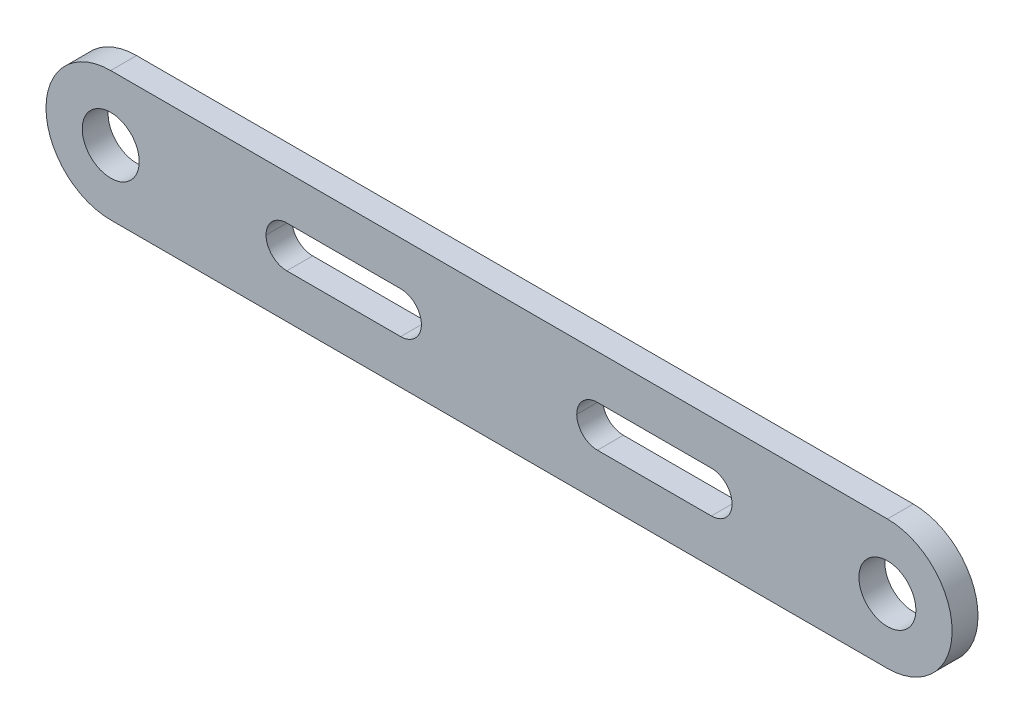
ISO-10303-21;
HEADER;
FILE_DESCRIPTION(('STEP AP214'),'2;1');
FILE_NAME('part.step','',(''),(''),'','','');
FILE_SCHEMA(('AUTOMOTIVE_DESIGN { 1 0 10303 214 1 1 1 1 }'));
ENDSEC;
DATA;
#1=APPLICATION_CONTEXT('core data for automotive mechanical design processes');
#2=APPLICATION_PROTOCOL_DEFINITION('international standard','automotive_design',2000,#1);
#3=PRODUCT_CONTEXT('',#1,'mechanical');
#4=PRODUCT('Part','Part','',(#3));
#5=PRODUCT_RELATED_PRODUCT_CATEGORY('part','',(#4));
#6=PRODUCT_DEFINITION_FORMATION('','',#4);
#7=PRODUCT_DEFINITION_CONTEXT('part definition',#1,'design');
#8=PRODUCT_DEFINITION('design','',#6,#7);
#9=PRODUCT_DEFINITION_SHAPE('','',#8);
#10=(LENGTH_UNIT() NAMED_UNIT(*) SI_UNIT(.MILLI.,.METRE.));
#11=(NAMED_UNIT(*) PLANE_ANGLE_UNIT() SI_UNIT($,.RADIAN.));
#12=(NAMED_UNIT(*) SI_UNIT($,.STERADIAN.) SOLID_ANGLE_UNIT());
#13=UNCERTAINTY_MEASURE_WITH_UNIT(LENGTH_MEASURE(1.E-05),#10,'distance_accuracy_value','');
#14=(GEOMETRIC_REPRESENTATION_CONTEXT(3) GLOBAL_UNCERTAINTY_ASSIGNED_CONTEXT((#13)) GLOBAL_UNIT_ASSIGNED_CONTEXT((#10,
#11,#12)) REPRESENTATION_CONTEXT('',''));
#15=CARTESIAN_POINT('',(0.,0.,0.));
#16=DIRECTION('',(0.,0.,1.));
#17=DIRECTION('',(1.,0.,0.));
#18=AXIS2_PLACEMENT_3D('',#15,#16,#17);
#19=CARTESIAN_POINT('',(-75.,0.,5.));
#20=DIRECTION('',(0.,0.,1.));
#21=DIRECTION('',(1.,0.,0.));
#22=AXIS2_PLACEMENT_3D('',#19,#20,#21);
#23=PLANE('',#22);
#24=DIRECTION('',(-1.,0.,0.));
#25=VECTOR('',#24,1.);
#26=CARTESIAN_POINT('',(-75.,4.00000000000001,5.));
#27=LINE('',#26,#25);
#28=CARTESIAN_POINT('',(41.,4.00000000000001,5.));
#29=VERTEX_POINT('',#28);
#30=CARTESIAN_POINT('',(19.,4.00000000000001,5.));
#31=VERTEX_POINT('',#30);
#32=EDGE_CURVE('E275',#29,#31,#27,.T.);
#33=ORIENTED_EDGE('',*,*,#32,.F.);
#34=CARTESIAN_POINT('',(41.,0.,5.));
#35=DIRECTION('',(0.,0.,1.));
#36=DIRECTION('',(1.,0.,0.));
#37=AXIS2_PLACEMENT_3D('',#34,#35,#36);
#38=CIRCLE('',#37,4.);
#39=CARTESIAN_POINT('',(45.,0.,5.));
#40=VERTEX_POINT('',#39);
#41=EDGE_CURVE('E213',#29,#40,#38,.F.);
#42=ORIENTED_EDGE('',*,*,#41,.T.);
#43=CARTESIAN_POINT('',(41.,0.,5.));
#44=DIRECTION('',(0.,0.,1.));
#45=DIRECTION('',(1.,0.,0.));
#46=AXIS2_PLACEMENT_3D('',#43,#44,#45);
#47=CIRCLE('',#46,4.);
#48=CARTESIAN_POINT('',(41.,-4.00000000000002,5.));
#49=VERTEX_POINT('',#48);
#50=EDGE_CURVE('E209',#40,#49,#47,.F.);
#51=ORIENTED_EDGE('',*,*,#50,.T.);
#52=DIRECTION('',(1.,0.,0.));
#53=VECTOR('',#52,1.);
#54=CARTESIAN_POINT('',(-75.,-4.00000000000002,5.));
#55=LINE('',#54,#53);
#56=CARTESIAN_POINT('',(19.,-4.00000000000002,5.));
#57=VERTEX_POINT('',#56);
#58=EDGE_CURVE('E272',#57,#49,#55,.T.);
#59=ORIENTED_EDGE('',*,*,#58,.F.);
#60=CARTESIAN_POINT('',(19.,0.,5.));
#61=DIRECTION('',(0.,0.,1.));
#62=DIRECTION('',(1.,0.,0.));
#63=AXIS2_PLACEMENT_3D('',#60,#61,#62);
#64=CIRCLE('',#63,4.);
#65=CARTESIAN_POINT('',(15.,0.,5.));
#66=VERTEX_POINT('',#65);
#67=EDGE_CURVE('E205',#57,#66,#64,.F.);
#68=ORIENTED_EDGE('',*,*,#67,.T.);
#69=CARTESIAN_POINT('',(19.,0.,5.));
#70=DIRECTION('',(0.,0.,1.));
#71=DIRECTION('',(1.,0.,0.));
#72=AXIS2_PLACEMENT_3D('',#69,#70,#71);
#73=CIRCLE('',#72,4.);
#74=EDGE_CURVE('E217',#66,#31,#73,.F.);
#75=ORIENTED_EDGE('',*,*,#74,.T.);
#76=EDGE_LOOP('',(#33,#42,#51,#59,#68,#75));
#77=FACE_BOUND('',#76,.T.);
#78=DIRECTION('',(-1.,0.,0.));
#79=VECTOR('',#78,1.);
#80=CARTESIAN_POINT('',(-75.,4.00000000000001,5.));
#81=LINE('',#80,#79);
#82=CARTESIAN_POINT('',(-19.,4.00000000000001,5.));
#83=VERTEX_POINT('',#82);
#84=CARTESIAN_POINT('',(-41.,4.00000000000001,5.));
#85=VERTEX_POINT('',#84);
#86=EDGE_CURVE('E270',#83,#85,#81,.T.);
#87=ORIENTED_EDGE('',*,*,#86,.F.);
#88=CARTESIAN_POINT('',(-19.,0.,5.));
#89=DIRECTION('',(0.,0.,1.));
#90=DIRECTION('',(1.,0.,0.));
#91=AXIS2_PLACEMENT_3D('',#88,#89,#90);
#92=CIRCLE('',#91,4.);
#93=CARTESIAN_POINT('',(-15.,0.,5.));
#94=VERTEX_POINT('',#93);
#95=EDGE_CURVE('E55',#83,#94,#92,.F.);
#96=ORIENTED_EDGE('',*,*,#95,.T.);
#97=CARTESIAN_POINT('',(-19.,0.,5.));
#98=DIRECTION('',(0.,0.,1.));
#99=DIRECTION('',(1.,0.,0.));
#100=AXIS2_PLACEMENT_3D('',#97,#98,#99);
#101=CIRCLE('',#100,4.);
#102=CARTESIAN_POINT('',(-19.,-4.00000000000001,5.));
#103=VERTEX_POINT('',#102);
#104=EDGE_CURVE('E224',#94,#103,#101,.F.);
#105=ORIENTED_EDGE('',*,*,#104,.T.);
#106=DIRECTION('',(1.,0.,0.));
#107=VECTOR('',#106,1.);
#108=CARTESIAN_POINT('',(-75.,-4.00000000000001,5.));
#109=LINE('',#108,#107);
#110=CARTESIAN_POINT('',(-41.,-4.00000000000001,5.));
#111=VERTEX_POINT('',#110);
#112=EDGE_CURVE('E267',#111,#103,#109,.T.);
#113=ORIENTED_EDGE('',*,*,#112,.F.);
#114=CARTESIAN_POINT('',(-41.,0.,5.));
#115=DIRECTION('',(0.,0.,1.));
#116=DIRECTION('',(1.,0.,0.));
#117=AXIS2_PLACEMENT_3D('',#114,#115,#116);
#118=CIRCLE('',#117,4.);
#119=CARTESIAN_POINT('',(-45.,0.,5.));
#120=VERTEX_POINT('',#119);
#121=EDGE_CURVE('E221',#111,#120,#118,.F.);
#122=ORIENTED_EDGE('',*,*,#121,.T.);
#123=CARTESIAN_POINT('',(-41.,0.,5.));
#124=DIRECTION('',(0.,0.,1.));
#125=DIRECTION('',(1.,0.,0.));
#126=AXIS2_PLACEMENT_3D('',#123,#124,#125);
#127=CIRCLE('',#126,4.);
#128=EDGE_CURVE('E11',#120,#85,#127,.F.);
#129=ORIENTED_EDGE('',*,*,#128,.T.);
#130=EDGE_LOOP('',(#87,#96,#105,#113,#122,#129));
#131=FACE_BOUND('',#130,.T.);
#132=CARTESIAN_POINT('',(75.,0.,5.));
#133=DIRECTION('',(0.,0.,1.));
#134=DIRECTION('',(-1.,0.,0.));
#135=AXIS2_PLACEMENT_3D('',#132,#133,#134);
#136=CIRCLE('',#135,5.5);
#137=CARTESIAN_POINT('',(69.5,0.,5.));
#138=VERTEX_POINT('',#137);
#139=EDGE_CURVE('E285',#138,#138,#136,.T.);
#140=ORIENTED_EDGE('',*,*,#139,.F.);
#141=EDGE_LOOP('',(#140));
#142=FACE_BOUND('',#141,.T.);
#143=CARTESIAN_POINT('',(-75.,0.,5.));
#144=DIRECTION('',(0.,0.,1.));
#145=DIRECTION('',(1.,0.,0.));
#146=AXIS2_PLACEMENT_3D('',#143,#144,#145);
#147=CIRCLE('',#146,12.5);
#148=CARTESIAN_POINT('',(-75.,12.5,5.));
#149=VERTEX_POINT('',#148);
#150=CARTESIAN_POINT('',(-75.,-12.5,5.));
#151=VERTEX_POINT('',#150);
#152=EDGE_CURVE('E164',#149,#151,#147,.T.);
#153=ORIENTED_EDGE('',*,*,#152,.T.);
#154=DIRECTION('',(1.,0.,0.));
#155=VECTOR('',#154,1.);
#156=CARTESIAN_POINT('',(75.,-12.5,5.));
#157=LINE('',#156,#155);
#158=CARTESIAN_POINT('',(75.,-12.5,5.));
#159=VERTEX_POINT('',#158);
#160=EDGE_CURVE('E153',#151,#159,#157,.T.);
#161=ORIENTED_EDGE('',*,*,#160,.T.);
#162=CARTESIAN_POINT('',(75.,0.,5.));
#163=DIRECTION('',(0.,0.,1.));
#164=DIRECTION('',(-1.,0.,0.));
#165=AXIS2_PLACEMENT_3D('',#162,#163,#164);
#166=CIRCLE('',#165,12.5);
#167=CARTESIAN_POINT('',(75.,12.5,5.));
#168=VERTEX_POINT('',#167);
#169=EDGE_CURVE('E163',#159,#168,#166,.T.);
#170=ORIENTED_EDGE('',*,*,#169,.T.);
#171=DIRECTION('',(-1.,0.,0.));
#172=VECTOR('',#171,1.);
#173=CARTESIAN_POINT('',(75.,12.5,5.));
#174=LINE('',#173,#172);
#175=EDGE_CURVE('E169',#168,#149,#174,.T.);
#176=ORIENTED_EDGE('',*,*,#175,.T.);
#177=EDGE_LOOP('',(#153,#161,#170,#176));
#178=FACE_BOUND('',#177,.T.);
#179=CARTESIAN_POINT('',(-75.,0.,5.));
#180=DIRECTION('',(0.,0.,1.));
#181=DIRECTION('',(1.,0.,0.));
#182=AXIS2_PLACEMENT_3D('',#179,#180,#181);
#183=CIRCLE('',#182,5.5);
#184=CARTESIAN_POINT('',(-69.5,0.,5.));
#185=VERTEX_POINT('',#184);
#186=EDGE_CURVE('E279',#185,#185,#183,.T.);
#187=ORIENTED_EDGE('',*,*,#186,.F.);
#188=EDGE_LOOP('',(#187));
#189=FACE_BOUND('',#188,.T.);
#190=ADVANCED_FACE('F38',(#77,#131,#142,#178,#189),#23,.T.);
#191=CARTESIAN_POINT('',(-75.,0.,0.));
#192=DIRECTION('',(0.,0.,1.));
#193=DIRECTION('',(1.,0.,0.));
#194=AXIS2_PLACEMENT_3D('',#191,#192,#193);
#195=PLANE('',#194);
#196=CARTESIAN_POINT('',(41.,0.,0.));
#197=DIRECTION('',(0.,0.,1.));
#198=DIRECTION('',(1.,0.,0.));
#199=AXIS2_PLACEMENT_3D('',#196,#197,#198);
#200=CIRCLE('',#199,4.);
#201=CARTESIAN_POINT('',(41.,-4.00000000000002,0.));
#202=VERTEX_POINT('',#201);
#203=CARTESIAN_POINT('',(45.,0.,0.));
#204=VERTEX_POINT('',#203);
#205=EDGE_CURVE('E207',#202,#204,#200,.T.);
#206=ORIENTED_EDGE('',*,*,#205,.T.);
#207=CARTESIAN_POINT('',(41.,0.,0.));
#208=DIRECTION('',(0.,0.,1.));
#209=DIRECTION('',(1.,0.,0.));
#210=AXIS2_PLACEMENT_3D('',#207,#208,#209);
#211=CIRCLE('',#210,4.);
#212=CARTESIAN_POINT('',(41.,4.00000000000001,0.));
#213=VERTEX_POINT('',#212);
#214=EDGE_CURVE('E211',#204,#213,#211,.T.);
#215=ORIENTED_EDGE('',*,*,#214,.T.);
#216=DIRECTION('',(1.,0.,0.));
#217=VECTOR('',#216,1.);
#218=CARTESIAN_POINT('',(45.,4.00000000000001,0.));
#219=LINE('',#218,#217);
#220=CARTESIAN_POINT('',(19.,4.00000000000001,0.));
#221=VERTEX_POINT('',#220);
#222=EDGE_CURVE('E261',#221,#213,#219,.T.);
#223=ORIENTED_EDGE('',*,*,#222,.F.);
#224=CARTESIAN_POINT('',(19.,0.,0.));
#225=DIRECTION('',(0.,0.,1.));
#226=DIRECTION('',(1.,0.,0.));
#227=AXIS2_PLACEMENT_3D('',#224,#225,#226);
#228=CIRCLE('',#227,4.);
#229=CARTESIAN_POINT('',(15.,0.,0.));
#230=VERTEX_POINT('',#229);
#231=EDGE_CURVE('E215',#221,#230,#228,.T.);
#232=ORIENTED_EDGE('',*,*,#231,.T.);
#233=CARTESIAN_POINT('',(19.,0.,0.));
#234=DIRECTION('',(0.,0.,1.));
#235=DIRECTION('',(1.,0.,0.));
#236=AXIS2_PLACEMENT_3D('',#233,#234,#235);
#237=CIRCLE('',#236,4.);
#238=CARTESIAN_POINT('',(19.,-4.00000000000002,0.));
#239=VERTEX_POINT('',#238);
#240=EDGE_CURVE('E203',#230,#239,#237,.T.);
#241=ORIENTED_EDGE('',*,*,#240,.T.);
#242=DIRECTION('',(-1.,0.,0.));
#243=VECTOR('',#242,1.);
#244=CARTESIAN_POINT('',(45.,-4.00000000000002,0.));
#245=LINE('',#244,#243);
#246=EDGE_CURVE('E258',#202,#239,#245,.T.);
#247=ORIENTED_EDGE('',*,*,#246,.F.);
#248=EDGE_LOOP('',(#206,#215,#223,#232,#241,#247));
#249=FACE_BOUND('',#248,.T.);
#250=CARTESIAN_POINT('',(-19.,0.,0.));
#251=DIRECTION('',(0.,0.,1.));
#252=DIRECTION('',(1.,0.,0.));
#253=AXIS2_PLACEMENT_3D('',#250,#251,#252);
#254=CIRCLE('',#253,4.);
#255=CARTESIAN_POINT('',(-19.,-4.00000000000001,0.));
#256=VERTEX_POINT('',#255);
#257=CARTESIAN_POINT('',(-15.,0.,0.));
#258=VERTEX_POINT('',#257);
#259=EDGE_CURVE('E63',#256,#258,#254,.T.);
#260=ORIENTED_EDGE('',*,*,#259,.T.);
#261=CARTESIAN_POINT('',(-19.,0.,0.));
#262=DIRECTION('',(0.,0.,1.));
#263=DIRECTION('',(1.,0.,0.));
#264=AXIS2_PLACEMENT_3D('',#261,#262,#263);
#265=CIRCLE('',#264,4.);
#266=CARTESIAN_POINT('',(-19.,4.00000000000001,0.));
#267=VERTEX_POINT('',#266);
#268=EDGE_CURVE('E226',#258,#267,#265,.T.);
#269=ORIENTED_EDGE('',*,*,#268,.T.);
#270=DIRECTION('',(1.,0.,0.));
#271=VECTOR('',#270,1.);
#272=CARTESIAN_POINT('',(-15.,4.00000000000001,0.));
#273=LINE('',#272,#271);
#274=CARTESIAN_POINT('',(-41.,4.00000000000001,0.));
#275=VERTEX_POINT('',#274);
#276=EDGE_CURVE('E252',#275,#267,#273,.T.);
#277=ORIENTED_EDGE('',*,*,#276,.F.);
#278=CARTESIAN_POINT('',(-41.,0.,0.));
#279=DIRECTION('',(0.,0.,1.));
#280=DIRECTION('',(1.,0.,0.));
#281=AXIS2_PLACEMENT_3D('',#278,#279,#280);
#282=CIRCLE('',#281,4.);
#283=CARTESIAN_POINT('',(-45.,0.,0.));
#284=VERTEX_POINT('',#283);
#285=EDGE_CURVE('E47',#275,#284,#282,.T.);
#286=ORIENTED_EDGE('',*,*,#285,.T.);
#287=CARTESIAN_POINT('',(-41.,0.,0.));
#288=DIRECTION('',(0.,0.,1.));
#289=DIRECTION('',(1.,0.,0.));
#290=AXIS2_PLACEMENT_3D('',#287,#288,#289);
#291=CIRCLE('',#290,4.);
#292=CARTESIAN_POINT('',(-41.,-4.00000000000001,0.));
#293=VERTEX_POINT('',#292);
#294=EDGE_CURVE('E219',#284,#293,#291,.T.);
#295=ORIENTED_EDGE('',*,*,#294,.T.);
#296=DIRECTION('',(-1.,0.,0.));
#297=VECTOR('',#296,1.);
#298=CARTESIAN_POINT('',(-15.,-4.00000000000001,0.));
#299=LINE('',#298,#297);
#300=EDGE_CURVE('E233',#256,#293,#299,.T.);
#301=ORIENTED_EDGE('',*,*,#300,.F.);
#302=EDGE_LOOP('',(#260,#269,#277,#286,#295,#301));
#303=FACE_BOUND('',#302,.T.);
#304=CARTESIAN_POINT('',(-75.,0.,0.));
#305=DIRECTION('',(0.,0.,1.));
#306=DIRECTION('',(1.,0.,0.));
#307=AXIS2_PLACEMENT_3D('',#304,#305,#306);
#308=CIRCLE('',#307,12.5);
#309=CARTESIAN_POINT('',(-75.,12.5,0.));
#310=VERTEX_POINT('',#309);
#311=CARTESIAN_POINT('',(-75.,-12.5,0.));
#312=VERTEX_POINT('',#311);
#313=EDGE_CURVE('E177',#310,#312,#308,.T.);
#314=ORIENTED_EDGE('',*,*,#313,.F.);
#315=DIRECTION('',(-1.,0.,0.));
#316=VECTOR('',#315,1.);
#317=CARTESIAN_POINT('',(75.,12.5,0.));
#318=LINE('',#317,#316);
#319=CARTESIAN_POINT('',(75.,12.5,0.));
#320=VERTEX_POINT('',#319);
#321=EDGE_CURVE('E173',#320,#310,#318,.T.);
#322=ORIENTED_EDGE('',*,*,#321,.F.);
#323=CARTESIAN_POINT('',(75.,0.,0.));
#324=DIRECTION('',(0.,0.,1.));
#325=DIRECTION('',(-1.,0.,0.));
#326=AXIS2_PLACEMENT_3D('',#323,#324,#325);
#327=CIRCLE('',#326,12.5);
#328=CARTESIAN_POINT('',(75.,-12.5,0.));
#329=VERTEX_POINT('',#328);
#330=EDGE_CURVE('E296',#329,#320,#327,.T.);
#331=ORIENTED_EDGE('',*,*,#330,.F.);
#332=DIRECTION('',(1.,0.,0.));
#333=VECTOR('',#332,1.);
#334=CARTESIAN_POINT('',(75.,-12.5,0.));
#335=LINE('',#334,#333);
#336=EDGE_CURVE('E294',#312,#329,#335,.T.);
#337=ORIENTED_EDGE('',*,*,#336,.F.);
#338=EDGE_LOOP('',(#314,#322,#331,#337));
#339=FACE_BOUND('',#338,.T.);
#340=CARTESIAN_POINT('',(75.,0.,0.));
#341=DIRECTION('',(0.,0.,1.));
#342=DIRECTION('',(-1.,0.,0.));
#343=AXIS2_PLACEMENT_3D('',#340,#341,#342);
#344=CIRCLE('',#343,5.5);
#345=CARTESIAN_POINT('',(69.5,0.,0.));
#346=VERTEX_POINT('',#345);
#347=EDGE_CURVE('E282',#346,#346,#344,.T.);
#348=ORIENTED_EDGE('',*,*,#347,.T.);
#349=EDGE_LOOP('',(#348));
#350=FACE_BOUND('',#349,.T.);
#351=CARTESIAN_POINT('',(-75.,0.,0.));
#352=DIRECTION('',(0.,0.,1.));
#353=DIRECTION('',(1.,0.,0.));
#354=AXIS2_PLACEMENT_3D('',#351,#352,#353);
#355=CIRCLE('',#354,5.5);
#356=CARTESIAN_POINT('',(-69.5,0.,0.));
#357=VERTEX_POINT('',#356);
#358=EDGE_CURVE('E278',#357,#357,#355,.T.);
#359=ORIENTED_EDGE('',*,*,#358,.T.);
#360=EDGE_LOOP('',(#359));
#361=FACE_BOUND('',#360,.T.);
#362=ADVANCED_FACE('F250',(#249,#303,#339,#350,#361),#195,.F.);
#363=CARTESIAN_POINT('',(-75.,0.,5.));
#364=DIRECTION('',(0.,0.,-1.));
#365=DIRECTION('',(-1.,0.,0.));
#366=AXIS2_PLACEMENT_3D('',#363,#364,#365);
#367=CYLINDRICAL_SURFACE('',#366,12.5);
#368=ORIENTED_EDGE('',*,*,#313,.T.);
#369=DIRECTION('',(0.,0.,-1.));
#370=VECTOR('',#369,1.);
#371=CARTESIAN_POINT('',(-75.,-12.5,5.));
#372=LINE('',#371,#370);
#373=EDGE_CURVE('E157',#151,#312,#372,.T.);
#374=ORIENTED_EDGE('',*,*,#373,.F.);
#375=ORIENTED_EDGE('',*,*,#152,.F.);
#376=DIRECTION('',(0.,0.,-1.));
#377=VECTOR('',#376,1.);
#378=CARTESIAN_POINT('',(-75.,12.5,5.));
#379=LINE('',#378,#377);
#380=EDGE_CURVE('E292',#149,#310,#379,.T.);
#381=ORIENTED_EDGE('',*,*,#380,.T.);
#382=EDGE_LOOP('',(#368,#374,#375,#381));
#383=FACE_BOUND('',#382,.T.);
#384=ADVANCED_FACE('F175',(#383),#367,.T.);
#385=CARTESIAN_POINT('',(75.,-12.5,5.));
#386=DIRECTION('',(0.,1.,0.));
#387=DIRECTION('',(0.,0.,1.));
#388=AXIS2_PLACEMENT_3D('',#385,#386,#387);
#389=PLANE('',#388);
#390=ORIENTED_EDGE('',*,*,#336,.T.);
#391=DIRECTION('',(0.,0.,-1.));
#392=VECTOR('',#391,1.);
#393=CARTESIAN_POINT('',(75.,-12.5,5.));
#394=LINE('',#393,#392);
#395=EDGE_CURVE('E160',#159,#329,#394,.T.);
#396=ORIENTED_EDGE('',*,*,#395,.F.);
#397=ORIENTED_EDGE('',*,*,#160,.F.);
#398=ORIENTED_EDGE('',*,*,#373,.T.);
#399=EDGE_LOOP('',(#390,#396,#397,#398));
#400=FACE_BOUND('',#399,.T.);
#401=ADVANCED_FACE('F155',(#400),#389,.F.);
#402=CARTESIAN_POINT('',(75.,0.,5.));
#403=DIRECTION('',(0.,0.,-1.));
#404=DIRECTION('',(-1.,0.,0.));
#405=AXIS2_PLACEMENT_3D('',#402,#403,#404);
#406=CYLINDRICAL_SURFACE('',#405,12.5);
#407=ORIENTED_EDGE('',*,*,#330,.T.);
#408=DIRECTION('',(0.,0.,-1.));
#409=VECTOR('',#408,1.);
#410=CARTESIAN_POINT('',(75.,12.5,5.));
#411=LINE('',#410,#409);
#412=EDGE_CURVE('E183',#168,#320,#411,.T.);
#413=ORIENTED_EDGE('',*,*,#412,.F.);
#414=ORIENTED_EDGE('',*,*,#169,.F.);
#415=ORIENTED_EDGE('',*,*,#395,.T.);
#416=EDGE_LOOP('',(#407,#413,#414,#415));
#417=FACE_BOUND('',#416,.T.);
#418=ADVANCED_FACE('F307',(#417),#406,.T.);
#419=CARTESIAN_POINT('',(75.,12.5,5.));
#420=DIRECTION('',(0.,-1.,0.));
#421=DIRECTION('',(0.,0.,-1.));
#422=AXIS2_PLACEMENT_3D('',#419,#420,#421);
#423=PLANE('',#422);
#424=ORIENTED_EDGE('',*,*,#321,.T.);
#425=ORIENTED_EDGE('',*,*,#380,.F.);
#426=ORIENTED_EDGE('',*,*,#175,.F.);
#427=ORIENTED_EDGE('',*,*,#412,.T.);
#428=EDGE_LOOP('',(#424,#425,#426,#427));
#429=FACE_BOUND('',#428,.T.);
#430=ADVANCED_FACE('F303',(#429),#423,.F.);
#431=CARTESIAN_POINT('',(75.,0.,5.));
#432=DIRECTION('',(0.,0.,-1.));
#433=DIRECTION('',(-1.,0.,0.));
#434=AXIS2_PLACEMENT_3D('',#431,#432,#433);
#435=CYLINDRICAL_SURFACE('',#434,5.5);
#436=ORIENTED_EDGE('',*,*,#139,.T.);
#437=EDGE_LOOP('',(#436));
#438=FACE_BOUND('',#437,.T.);
#439=ORIENTED_EDGE('',*,*,#347,.F.);
#440=EDGE_LOOP('',(#439));
#441=FACE_BOUND('',#440,.T.);
#442=ADVANCED_FACE('F314',(#438,#441),#435,.F.);
#443=CARTESIAN_POINT('',(-75.,0.,5.));
#444=DIRECTION('',(0.,0.,-1.));
#445=DIRECTION('',(-1.,0.,0.));
#446=AXIS2_PLACEMENT_3D('',#443,#444,#445);
#447=CYLINDRICAL_SURFACE('',#446,5.5);
#448=ORIENTED_EDGE('',*,*,#186,.T.);
#449=EDGE_LOOP('',(#448));
#450=FACE_BOUND('',#449,.T.);
#451=ORIENTED_EDGE('',*,*,#358,.F.);
#452=EDGE_LOOP('',(#451));
#453=FACE_BOUND('',#452,.T.);
#454=ADVANCED_FACE('F329',(#450,#453),#447,.F.);
#455=CARTESIAN_POINT('',(-15.,4.00000000000001,10.));
#456=DIRECTION('',(0.,1.,0.));
#457=DIRECTION('',(0.,0.,1.));
#458=AXIS2_PLACEMENT_3D('',#455,#456,#457);
#459=PLANE('',#458);
#460=ORIENTED_EDGE('',*,*,#276,.T.);
#461=DIRECTION('',(0.,0.,-1.));
#462=VECTOR('',#461,1.);
#463=CARTESIAN_POINT('',(-19.,4.00000000000001,5.));
#464=LINE('',#463,#462);
#465=EDGE_CURVE('E201',#267,#83,#464,.F.);
#466=ORIENTED_EDGE('',*,*,#465,.T.);
#467=ORIENTED_EDGE('',*,*,#86,.T.);
#468=DIRECTION('',(0.,0.,-1.));
#469=VECTOR('',#468,1.);
#470=CARTESIAN_POINT('',(-41.,4.00000000000001,0.));
#471=LINE('',#470,#469);
#472=EDGE_CURVE('E199',#85,#275,#471,.T.);
#473=ORIENTED_EDGE('',*,*,#472,.T.);
#474=EDGE_LOOP('',(#460,#466,#467,#473));
#475=FACE_BOUND('',#474,.T.);
#476=ADVANCED_FACE('F255',(#475),#459,.F.);
#477=CARTESIAN_POINT('',(-15.,-4.00000000000001,10.));
#478=DIRECTION('',(0.,-1.,0.));
#479=DIRECTION('',(0.,0.,-1.));
#480=AXIS2_PLACEMENT_3D('',#477,#478,#479);
#481=PLANE('',#480);
#482=ORIENTED_EDGE('',*,*,#300,.T.);
#483=DIRECTION('',(0.,0.,-1.));
#484=VECTOR('',#483,1.);
#485=CARTESIAN_POINT('',(-41.,-4.00000000000001,5.));
#486=LINE('',#485,#484);
#487=EDGE_CURVE('E196',#293,#111,#486,.F.);
#488=ORIENTED_EDGE('',*,*,#487,.T.);
#489=ORIENTED_EDGE('',*,*,#112,.T.);
#490=DIRECTION('',(0.,0.,-1.));
#491=VECTOR('',#490,1.);
#492=CARTESIAN_POINT('',(-19.,-4.00000000000001,0.));
#493=LINE('',#492,#491);
#494=EDGE_CURVE('E193',#103,#256,#493,.T.);
#495=ORIENTED_EDGE('',*,*,#494,.T.);
#496=EDGE_LOOP('',(#482,#488,#489,#495));
#497=FACE_BOUND('',#496,.T.);
#498=ADVANCED_FACE('F334',(#497),#481,.F.);
#499=CARTESIAN_POINT('',(45.,4.00000000000001,10.));
#500=DIRECTION('',(0.,1.,0.));
#501=DIRECTION('',(0.,0.,1.));
#502=AXIS2_PLACEMENT_3D('',#499,#500,#501);
#503=PLANE('',#502);
#504=ORIENTED_EDGE('',*,*,#222,.T.);
#505=DIRECTION('',(0.,0.,-1.));
#506=VECTOR('',#505,1.);
#507=CARTESIAN_POINT('',(41.,4.00000000000001,5.));
#508=LINE('',#507,#506);
#509=EDGE_CURVE('E191',#213,#29,#508,.F.);
#510=ORIENTED_EDGE('',*,*,#509,.T.);
#511=ORIENTED_EDGE('',*,*,#32,.T.);
#512=DIRECTION('',(0.,0.,-1.));
#513=VECTOR('',#512,1.);
#514=CARTESIAN_POINT('',(19.,4.00000000000001,0.));
#515=LINE('',#514,#513);
#516=EDGE_CURVE('E189',#31,#221,#515,.T.);
#517=ORIENTED_EDGE('',*,*,#516,.T.);
#518=EDGE_LOOP('',(#504,#510,#511,#517));
#519=FACE_BOUND('',#518,.T.);
#520=ADVANCED_FACE('F337',(#519),#503,.F.);
#521=CARTESIAN_POINT('',(45.,-4.00000000000002,10.));
#522=DIRECTION('',(0.,-1.,0.));
#523=DIRECTION('',(0.,0.,-1.));
#524=AXIS2_PLACEMENT_3D('',#521,#522,#523);
#525=PLANE('',#524);
#526=ORIENTED_EDGE('',*,*,#246,.T.);
#527=DIRECTION('',(0.,0.,-1.));
#528=VECTOR('',#527,1.);
#529=CARTESIAN_POINT('',(19.,-4.00000000000002,5.));
#530=LINE('',#529,#528);
#531=EDGE_CURVE('E181',#239,#57,#530,.F.);
#532=ORIENTED_EDGE('',*,*,#531,.T.);
#533=ORIENTED_EDGE('',*,*,#58,.T.);
#534=DIRECTION('',(0.,0.,-1.));
#535=VECTOR('',#534,1.);
#536=CARTESIAN_POINT('',(41.,-4.00000000000002,0.));
#537=LINE('',#536,#535);
#538=EDGE_CURVE('E178',#49,#202,#537,.T.);
#539=ORIENTED_EDGE('',*,*,#538,.T.);
#540=EDGE_LOOP('',(#526,#532,#533,#539));
#541=FACE_BOUND('',#540,.T.);
#542=ADVANCED_FACE('F341',(#541),#525,.F.);
#543=CARTESIAN_POINT('',(19.,0.,10.));
#544=DIRECTION('',(0.,0.,1.));
#545=DIRECTION('',(1.,0.,0.));
#546=AXIS2_PLACEMENT_3D('',#543,#544,#545);
#547=CYLINDRICAL_SURFACE('',#546,4.);
#548=ORIENTED_EDGE('',*,*,#516,.F.);
#549=ORIENTED_EDGE('',*,*,#74,.F.);
#550=DIRECTION('',(0.,0.,-1.));
#551=VECTOR('',#550,1.);
#552=CARTESIAN_POINT('',(15.,0.,5.));
#553=LINE('',#552,#551);
#554=EDGE_CURVE('E230',#230,#66,#553,.F.);
#555=ORIENTED_EDGE('',*,*,#554,.F.);
#556=ORIENTED_EDGE('',*,*,#231,.F.);
#557=EDGE_LOOP('',(#548,#549,#555,#556));
#558=FACE_BOUND('',#557,.T.);
#559=ADVANCED_FACE('F344',(#558),#547,.F.);
#560=CARTESIAN_POINT('',(19.,0.,10.));
#561=DIRECTION('',(0.,0.,1.));
#562=DIRECTION('',(1.,0.,0.));
#563=AXIS2_PLACEMENT_3D('',#560,#561,#562);
#564=CYLINDRICAL_SURFACE('',#563,4.);
#565=ORIENTED_EDGE('',*,*,#67,.F.);
#566=ORIENTED_EDGE('',*,*,#531,.F.);
#567=ORIENTED_EDGE('',*,*,#240,.F.);
#568=ORIENTED_EDGE('',*,*,#554,.T.);
#569=EDGE_LOOP('',(#565,#566,#567,#568));
#570=FACE_BOUND('',#569,.T.);
#571=ADVANCED_FACE('F370',(#570),#564,.F.);
#572=CARTESIAN_POINT('',(41.,0.,10.));
#573=DIRECTION('',(0.,0.,1.));
#574=DIRECTION('',(1.,0.,0.));
#575=AXIS2_PLACEMENT_3D('',#572,#573,#574);
#576=CYLINDRICAL_SURFACE('',#575,4.);
#577=DIRECTION('',(0.,0.,-1.));
#578=VECTOR('',#577,1.);
#579=CARTESIAN_POINT('',(45.,0.,0.));
#580=LINE('',#579,#578);
#581=EDGE_CURVE('E234',#40,#204,#580,.T.);
#582=ORIENTED_EDGE('',*,*,#581,.F.);
#583=ORIENTED_EDGE('',*,*,#41,.F.);
#584=ORIENTED_EDGE('',*,*,#509,.F.);
#585=ORIENTED_EDGE('',*,*,#214,.F.);
#586=EDGE_LOOP('',(#582,#583,#584,#585));
#587=FACE_BOUND('',#586,.T.);
#588=ADVANCED_FACE('F359',(#587),#576,.F.);
#589=CARTESIAN_POINT('',(41.,0.,10.));
#590=DIRECTION('',(0.,0.,1.));
#591=DIRECTION('',(1.,0.,0.));
#592=AXIS2_PLACEMENT_3D('',#589,#590,#591);
#593=CYLINDRICAL_SURFACE('',#592,4.);
#594=ORIENTED_EDGE('',*,*,#50,.F.);
#595=ORIENTED_EDGE('',*,*,#581,.T.);
#596=ORIENTED_EDGE('',*,*,#205,.F.);
#597=ORIENTED_EDGE('',*,*,#538,.F.);
#598=EDGE_LOOP('',(#594,#595,#596,#597));
#599=FACE_BOUND('',#598,.T.);
#600=ADVANCED_FACE('F372',(#599),#593,.F.);
#601=CARTESIAN_POINT('',(-41.,0.,10.));
#602=DIRECTION('',(0.,0.,1.));
#603=DIRECTION('',(1.,0.,0.));
#604=AXIS2_PLACEMENT_3D('',#601,#602,#603);
#605=CYLINDRICAL_SURFACE('',#604,4.);
#606=ORIENTED_EDGE('',*,*,#472,.F.);
#607=ORIENTED_EDGE('',*,*,#128,.F.);
#608=DIRECTION('',(0.,0.,-1.));
#609=VECTOR('',#608,1.);
#610=CARTESIAN_POINT('',(-45.,0.,5.));
#611=LINE('',#610,#609);
#612=EDGE_CURVE('E236',#284,#120,#611,.F.);
#613=ORIENTED_EDGE('',*,*,#612,.F.);
#614=ORIENTED_EDGE('',*,*,#285,.F.);
#615=EDGE_LOOP('',(#606,#607,#613,#614));
#616=FACE_BOUND('',#615,.T.);
#617=ADVANCED_FACE('F374',(#616),#605,.F.);
#618=CARTESIAN_POINT('',(-41.,0.,10.));
#619=DIRECTION('',(0.,0.,1.));
#620=DIRECTION('',(1.,0.,0.));
#621=AXIS2_PLACEMENT_3D('',#618,#619,#620);
#622=CYLINDRICAL_SURFACE('',#621,4.);
#623=ORIENTED_EDGE('',*,*,#121,.F.);
#624=ORIENTED_EDGE('',*,*,#487,.F.);
#625=ORIENTED_EDGE('',*,*,#294,.F.);
#626=ORIENTED_EDGE('',*,*,#612,.T.);
#627=EDGE_LOOP('',(#623,#624,#625,#626));
#628=FACE_BOUND('',#627,.T.);
#629=ADVANCED_FACE('F380',(#628),#622,.F.);
#630=CARTESIAN_POINT('',(-19.,0.,10.));
#631=DIRECTION('',(0.,0.,1.));
#632=DIRECTION('',(1.,0.,0.));
#633=AXIS2_PLACEMENT_3D('',#630,#631,#632);
#634=CYLINDRICAL_SURFACE('',#633,4.);
#635=DIRECTION('',(0.,0.,-1.));
#636=VECTOR('',#635,1.);
#637=CARTESIAN_POINT('',(-15.,0.,0.));
#638=LINE('',#637,#636);
#639=EDGE_CURVE('E42',#94,#258,#638,.T.);
#640=ORIENTED_EDGE('',*,*,#639,.F.);
#641=ORIENTED_EDGE('',*,*,#95,.F.);
#642=ORIENTED_EDGE('',*,*,#465,.F.);
#643=ORIENTED_EDGE('',*,*,#268,.F.);
#644=EDGE_LOOP('',(#640,#641,#642,#643));
#645=FACE_BOUND('',#644,.T.);
#646=ADVANCED_FACE('F40',(#645),#634,.F.);
#647=CARTESIAN_POINT('',(-19.,0.,10.));
#648=DIRECTION('',(0.,0.,1.));
#649=DIRECTION('',(1.,0.,0.));
#650=AXIS2_PLACEMENT_3D('',#647,#648,#649);
#651=CYLINDRICAL_SURFACE('',#650,4.);
#652=ORIENTED_EDGE('',*,*,#104,.F.);
#653=ORIENTED_EDGE('',*,*,#639,.T.);
#654=ORIENTED_EDGE('',*,*,#259,.F.);
#655=ORIENTED_EDGE('',*,*,#494,.F.);
#656=EDGE_LOOP('',(#652,#653,#654,#655));
#657=FACE_BOUND('',#656,.T.);
#658=ADVANCED_FACE('F244',(#657),#651,.F.);
#659=CLOSED_SHELL('',(#190,#362,#384,#401,#418,#430,#442,#454,#476,#498,#520,#542,#559,#571,
#588,#600,#617,#629,#646,#658));
#660=MANIFOLD_SOLID_BREP('B2',#659);
#661=ADVANCED_BREP_SHAPE_REPRESENTATION('',(#18,#660),#14);
#662=SHAPE_DEFINITION_REPRESENTATION(#9,#661);
ENDSEC;
END-ISO-10303-21;
